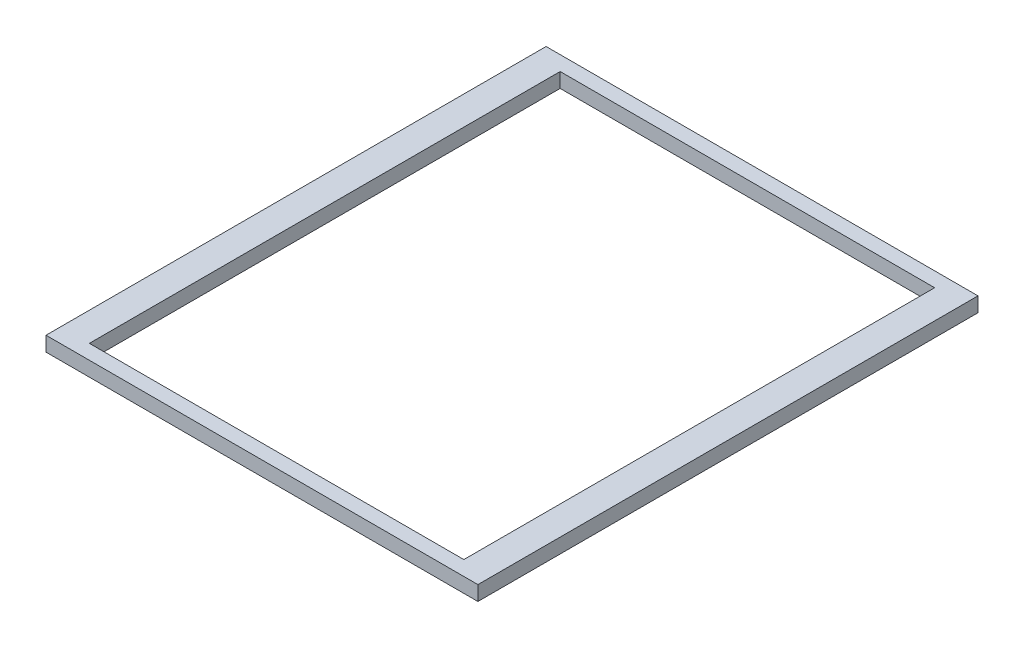
ISO-10303-21;
HEADER;
FILE_DESCRIPTION(('STEP AP214'),'2;1');
FILE_NAME('part.step','',(''),(''),'','','');
FILE_SCHEMA(('AUTOMOTIVE_DESIGN { 1 0 10303 214 1 1 1 1 }'));
ENDSEC;
DATA;
#1=APPLICATION_CONTEXT('core data for automotive mechanical design processes');
#2=APPLICATION_PROTOCOL_DEFINITION('international standard','automotive_design',2000,#1);
#3=PRODUCT_CONTEXT('',#1,'mechanical');
#4=PRODUCT('Part','Part','',(#3));
#5=PRODUCT_RELATED_PRODUCT_CATEGORY('part','',(#4));
#6=PRODUCT_DEFINITION_FORMATION('','',#4);
#7=PRODUCT_DEFINITION_CONTEXT('part definition',#1,'design');
#8=PRODUCT_DEFINITION('design','',#6,#7);
#9=PRODUCT_DEFINITION_SHAPE('','',#8);
#10=(LENGTH_UNIT() NAMED_UNIT(*) SI_UNIT(.MILLI.,.METRE.));
#11=(NAMED_UNIT(*) PLANE_ANGLE_UNIT() SI_UNIT($,.RADIAN.));
#12=(NAMED_UNIT(*) SI_UNIT($,.STERADIAN.) SOLID_ANGLE_UNIT());
#13=UNCERTAINTY_MEASURE_WITH_UNIT(LENGTH_MEASURE(1.E-05),#10,'distance_accuracy_value','');
#14=(GEOMETRIC_REPRESENTATION_CONTEXT(3) GLOBAL_UNCERTAINTY_ASSIGNED_CONTEXT((#13)) GLOBAL_UNIT_ASSIGNED_CONTEXT((#10,
#11,#12)) REPRESENTATION_CONTEXT('',''));
#15=CARTESIAN_POINT('',(0.,0.,0.));
#16=DIRECTION('',(0.,0.,1.));
#17=DIRECTION('',(1.,0.,0.));
#18=AXIS2_PLACEMENT_3D('',#15,#16,#17);
#19=CARTESIAN_POINT('',(-10.27,20.47,328.78));
#20=DIRECTION('',(0.,1.,0.));
#21=DIRECTION('',(0.,0.,1.));
#22=AXIS2_PLACEMENT_3D('',#19,#20,#21);
#23=PLANE('',#22);
#24=DIRECTION('',(-1.,0.,0.));
#25=VECTOR('',#24,1.);
#26=CARTESIAN_POINT('',(261.525,20.47,-328.78));
#27=LINE('',#26,#25);
#28=CARTESIAN_POINT('',(261.525,20.47,-328.78));
#29=VERTEX_POINT('',#28);
#30=CARTESIAN_POINT('',(-261.525,20.47,-328.78));
#31=VERTEX_POINT('',#30);
#32=EDGE_CURVE('E102',#29,#31,#27,.T.);
#33=ORIENTED_EDGE('',*,*,#32,.F.);
#34=DIRECTION('',(0.,0.,-1.));
#35=VECTOR('',#34,1.);
#36=CARTESIAN_POINT('',(261.525,20.47,-328.78));
#37=LINE('',#36,#35);
#38=CARTESIAN_POINT('',(261.525,20.47,328.78));
#39=VERTEX_POINT('',#38);
#40=EDGE_CURVE('E104',#39,#29,#37,.T.);
#41=ORIENTED_EDGE('',*,*,#40,.F.);
#42=DIRECTION('',(1.,0.,0.));
#43=VECTOR('',#42,1.);
#44=CARTESIAN_POINT('',(261.525,20.47,328.78));
#45=LINE('',#44,#43);
#46=CARTESIAN_POINT('',(-261.525,20.47,328.78));
#47=VERTEX_POINT('',#46);
#48=EDGE_CURVE('E11',#47,#39,#45,.T.);
#49=ORIENTED_EDGE('',*,*,#48,.F.);
#50=DIRECTION('',(0.,0.,1.));
#51=VECTOR('',#50,1.);
#52=CARTESIAN_POINT('',(-261.525,20.47,-328.78));
#53=LINE('',#52,#51);
#54=EDGE_CURVE('E106',#31,#47,#53,.T.);
#55=ORIENTED_EDGE('',*,*,#54,.F.);
#56=EDGE_LOOP('',(#33,#41,#49,#55));
#57=FACE_BOUND('',#56,.T.);
#58=DIRECTION('',(-1.,0.,0.));
#59=VECTOR('',#58,1.);
#60=CARTESIAN_POINT('',(-301.625,20.47,-349.25));
#61=LINE('',#60,#59);
#62=CARTESIAN_POINT('',(301.625,20.47,-349.25));
#63=VERTEX_POINT('',#62);
#64=CARTESIAN_POINT('',(-301.625,20.47,-349.25));
#65=VERTEX_POINT('',#64);
#66=EDGE_CURVE('E141',#63,#65,#61,.T.);
#67=ORIENTED_EDGE('',*,*,#66,.T.);
#68=DIRECTION('',(0.,0.,1.));
#69=VECTOR('',#68,1.);
#70=CARTESIAN_POINT('',(-301.625,20.47,349.25));
#71=LINE('',#70,#69);
#72=CARTESIAN_POINT('',(-301.625,20.47,349.25));
#73=VERTEX_POINT('',#72);
#74=EDGE_CURVE('E144',#65,#73,#71,.T.);
#75=ORIENTED_EDGE('',*,*,#74,.T.);
#76=DIRECTION('',(1.,0.,0.));
#77=VECTOR('',#76,1.);
#78=CARTESIAN_POINT('',(-301.625,20.47,349.25));
#79=LINE('',#78,#77);
#80=CARTESIAN_POINT('',(301.625,20.47,349.25));
#81=VERTEX_POINT('',#80);
#82=EDGE_CURVE('E147',#73,#81,#79,.T.);
#83=ORIENTED_EDGE('',*,*,#82,.T.);
#84=DIRECTION('',(0.,0.,-1.));
#85=VECTOR('',#84,1.);
#86=CARTESIAN_POINT('',(301.625,20.47,349.25));
#87=LINE('',#86,#85);
#88=EDGE_CURVE('E137',#81,#63,#87,.T.);
#89=ORIENTED_EDGE('',*,*,#88,.T.);
#90=EDGE_LOOP('',(#67,#75,#83,#89));
#91=FACE_BOUND('',#90,.T.);
#92=ADVANCED_FACE('F34',(#57,#91),#23,.T.);
#93=CARTESIAN_POINT('',(-301.625,20.47,-349.25));
#94=DIRECTION('',(0.,0.,1.));
#95=DIRECTION('',(1.,0.,0.));
#96=AXIS2_PLACEMENT_3D('',#93,#94,#95);
#97=PLANE('',#96);
#98=ORIENTED_EDGE('',*,*,#66,.F.);
#99=DIRECTION('',(0.,-1.,0.));
#100=VECTOR('',#99,1.);
#101=CARTESIAN_POINT('',(301.625,20.47,-349.25));
#102=LINE('',#101,#100);
#103=CARTESIAN_POINT('',(301.625,0.,-349.25));
#104=VERTEX_POINT('',#103);
#105=EDGE_CURVE('E163',#63,#104,#102,.T.);
#106=ORIENTED_EDGE('',*,*,#105,.T.);
#107=DIRECTION('',(-1.,0.,0.));
#108=VECTOR('',#107,1.);
#109=CARTESIAN_POINT('',(-301.625,0.,-349.25));
#110=LINE('',#109,#108);
#111=CARTESIAN_POINT('',(-301.625,0.,-349.25));
#112=VERTEX_POINT('',#111);
#113=EDGE_CURVE('E134',#104,#112,#110,.T.);
#114=ORIENTED_EDGE('',*,*,#113,.T.);
#115=DIRECTION('',(0.,-1.,0.));
#116=VECTOR('',#115,1.);
#117=CARTESIAN_POINT('',(-301.625,20.47,-349.25));
#118=LINE('',#117,#116);
#119=EDGE_CURVE('E160',#65,#112,#118,.T.);
#120=ORIENTED_EDGE('',*,*,#119,.F.);
#121=EDGE_LOOP('',(#98,#106,#114,#120));
#122=FACE_BOUND('',#121,.T.);
#123=ADVANCED_FACE('F167',(#122),#97,.F.);
#124=CARTESIAN_POINT('',(301.625,20.47,349.25));
#125=DIRECTION('',(-1.,0.,0.));
#126=DIRECTION('',(0.,0.,1.));
#127=AXIS2_PLACEMENT_3D('',#124,#125,#126);
#128=PLANE('',#127);
#129=ORIENTED_EDGE('',*,*,#88,.F.);
#130=DIRECTION('',(0.,-1.,0.));
#131=VECTOR('',#130,1.);
#132=CARTESIAN_POINT('',(301.625,20.47,349.25));
#133=LINE('',#132,#131);
#134=CARTESIAN_POINT('',(301.625,0.,349.25));
#135=VERTEX_POINT('',#134);
#136=EDGE_CURVE('E149',#81,#135,#133,.T.);
#137=ORIENTED_EDGE('',*,*,#136,.T.);
#138=DIRECTION('',(0.,0.,-1.));
#139=VECTOR('',#138,1.);
#140=CARTESIAN_POINT('',(301.625,0.,349.25));
#141=LINE('',#140,#139);
#142=EDGE_CURVE('E132',#135,#104,#141,.T.);
#143=ORIENTED_EDGE('',*,*,#142,.T.);
#144=ORIENTED_EDGE('',*,*,#105,.F.);
#145=EDGE_LOOP('',(#129,#137,#143,#144));
#146=FACE_BOUND('',#145,.T.);
#147=ADVANCED_FACE('F171',(#146),#128,.F.);
#148=CARTESIAN_POINT('',(-261.525,20.47,-328.78));
#149=DIRECTION('',(1.,0.,0.));
#150=DIRECTION('',(0.,0.,-1.));
#151=AXIS2_PLACEMENT_3D('',#148,#149,#150);
#152=PLANE('',#151);
#153=DIRECTION('',(0.,-1.,0.));
#154=VECTOR('',#153,1.);
#155=CARTESIAN_POINT('',(-261.525,20.47,-328.78));
#156=LINE('',#155,#154);
#157=CARTESIAN_POINT('',(-261.525,0.,-328.78));
#158=VERTEX_POINT('',#157);
#159=EDGE_CURVE('E110',#31,#158,#156,.T.);
#160=ORIENTED_EDGE('',*,*,#159,.F.);
#161=ORIENTED_EDGE('',*,*,#54,.T.);
#162=DIRECTION('',(0.,-1.,0.));
#163=VECTOR('',#162,1.);
#164=CARTESIAN_POINT('',(-261.525,20.47,328.78));
#165=LINE('',#164,#163);
#166=CARTESIAN_POINT('',(-261.525,0.,328.78));
#167=VERTEX_POINT('',#166);
#168=EDGE_CURVE('E119',#47,#167,#165,.T.);
#169=ORIENTED_EDGE('',*,*,#168,.T.);
#170=DIRECTION('',(0.,0.,1.));
#171=VECTOR('',#170,1.);
#172=CARTESIAN_POINT('',(-261.525,0.,-328.78));
#173=LINE('',#172,#171);
#174=EDGE_CURVE('E43',#158,#167,#173,.T.);
#175=ORIENTED_EDGE('',*,*,#174,.F.);
#176=EDGE_LOOP('',(#160,#161,#169,#175));
#177=FACE_BOUND('',#176,.T.);
#178=ADVANCED_FACE('F130',(#177),#152,.T.);
#179=CARTESIAN_POINT('',(261.525,20.47,-328.78));
#180=DIRECTION('',(-1.,0.,0.));
#181=DIRECTION('',(0.,0.,1.));
#182=AXIS2_PLACEMENT_3D('',#179,#180,#181);
#183=PLANE('',#182);
#184=DIRECTION('',(0.,-1.,0.));
#185=VECTOR('',#184,1.);
#186=CARTESIAN_POINT('',(261.525,20.47,328.78));
#187=LINE('',#186,#185);
#188=CARTESIAN_POINT('',(261.525,0.,328.78));
#189=VERTEX_POINT('',#188);
#190=EDGE_CURVE('E111',#39,#189,#187,.T.);
#191=ORIENTED_EDGE('',*,*,#190,.F.);
#192=ORIENTED_EDGE('',*,*,#40,.T.);
#193=DIRECTION('',(0.,-1.,0.));
#194=VECTOR('',#193,1.);
#195=CARTESIAN_POINT('',(261.525,20.47,-328.78));
#196=LINE('',#195,#194);
#197=CARTESIAN_POINT('',(261.525,0.,-328.78));
#198=VERTEX_POINT('',#197);
#199=EDGE_CURVE('E70',#29,#198,#196,.T.);
#200=ORIENTED_EDGE('',*,*,#199,.T.);
#201=DIRECTION('',(0.,0.,-1.));
#202=VECTOR('',#201,1.);
#203=CARTESIAN_POINT('',(261.525,0.,-328.78));
#204=LINE('',#203,#202);
#205=EDGE_CURVE('E124',#189,#198,#204,.T.);
#206=ORIENTED_EDGE('',*,*,#205,.F.);
#207=EDGE_LOOP('',(#191,#192,#200,#206));
#208=FACE_BOUND('',#207,.T.);
#209=ADVANCED_FACE('F36',(#208),#183,.T.);
#210=CARTESIAN_POINT('',(0.,0.,0.));
#211=DIRECTION('',(0.,-1.,0.));
#212=DIRECTION('',(0.,0.,-1.));
#213=AXIS2_PLACEMENT_3D('',#210,#211,#212);
#214=PLANE('',#213);
#215=ORIENTED_EDGE('',*,*,#142,.F.);
#216=DIRECTION('',(1.,0.,0.));
#217=VECTOR('',#216,1.);
#218=CARTESIAN_POINT('',(-301.625,0.,349.25));
#219=LINE('',#218,#217);
#220=CARTESIAN_POINT('',(-301.625,0.,349.25));
#221=VERTEX_POINT('',#220);
#222=EDGE_CURVE('E140',#221,#135,#219,.T.);
#223=ORIENTED_EDGE('',*,*,#222,.F.);
#224=DIRECTION('',(0.,0.,1.));
#225=VECTOR('',#224,1.);
#226=CARTESIAN_POINT('',(-301.625,0.,349.25));
#227=LINE('',#226,#225);
#228=EDGE_CURVE('E152',#112,#221,#227,.T.);
#229=ORIENTED_EDGE('',*,*,#228,.F.);
#230=ORIENTED_EDGE('',*,*,#113,.F.);
#231=EDGE_LOOP('',(#215,#223,#229,#230));
#232=FACE_BOUND('',#231,.T.);
#233=DIRECTION('',(-1.,0.,0.));
#234=VECTOR('',#233,1.);
#235=CARTESIAN_POINT('',(261.525,0.,-328.78));
#236=LINE('',#235,#234);
#237=EDGE_CURVE('E115',#198,#158,#236,.T.);
#238=ORIENTED_EDGE('',*,*,#237,.T.);
#239=ORIENTED_EDGE('',*,*,#174,.T.);
#240=DIRECTION('',(1.,0.,0.));
#241=VECTOR('',#240,1.);
#242=CARTESIAN_POINT('',(261.525,0.,328.78));
#243=LINE('',#242,#241);
#244=EDGE_CURVE('E51',#167,#189,#243,.T.);
#245=ORIENTED_EDGE('',*,*,#244,.T.);
#246=ORIENTED_EDGE('',*,*,#205,.T.);
#247=EDGE_LOOP('',(#238,#239,#245,#246));
#248=FACE_BOUND('',#247,.T.);
#249=ADVANCED_FACE('F175',(#232,#248),#214,.T.);
#250=CARTESIAN_POINT('',(261.525,20.47,-328.78));
#251=DIRECTION('',(0.,0.,1.));
#252=DIRECTION('',(1.,0.,0.));
#253=AXIS2_PLACEMENT_3D('',#250,#251,#252);
#254=PLANE('',#253);
#255=ORIENTED_EDGE('',*,*,#237,.F.);
#256=ORIENTED_EDGE('',*,*,#199,.F.);
#257=ORIENTED_EDGE('',*,*,#32,.T.);
#258=ORIENTED_EDGE('',*,*,#159,.T.);
#259=EDGE_LOOP('',(#255,#256,#257,#258));
#260=FACE_BOUND('',#259,.T.);
#261=ADVANCED_FACE('F113',(#260),#254,.T.);
#262=CARTESIAN_POINT('',(261.525,20.47,328.78));
#263=DIRECTION('',(0.,0.,-1.));
#264=DIRECTION('',(-1.,0.,0.));
#265=AXIS2_PLACEMENT_3D('',#262,#263,#264);
#266=PLANE('',#265);
#267=ORIENTED_EDGE('',*,*,#244,.F.);
#268=ORIENTED_EDGE('',*,*,#168,.F.);
#269=ORIENTED_EDGE('',*,*,#48,.T.);
#270=ORIENTED_EDGE('',*,*,#190,.T.);
#271=EDGE_LOOP('',(#267,#268,#269,#270));
#272=FACE_BOUND('',#271,.T.);
#273=ADVANCED_FACE('F131',(#272),#266,.T.);
#274=CARTESIAN_POINT('',(-301.625,20.47,349.25));
#275=DIRECTION('',(1.,0.,0.));
#276=DIRECTION('',(0.,0.,-1.));
#277=AXIS2_PLACEMENT_3D('',#274,#275,#276);
#278=PLANE('',#277);
#279=ORIENTED_EDGE('',*,*,#74,.F.);
#280=ORIENTED_EDGE('',*,*,#119,.T.);
#281=ORIENTED_EDGE('',*,*,#228,.T.);
#282=DIRECTION('',(0.,-1.,0.));
#283=VECTOR('',#282,1.);
#284=CARTESIAN_POINT('',(-301.625,20.47,349.25));
#285=LINE('',#284,#283);
#286=EDGE_CURVE('E157',#73,#221,#285,.T.);
#287=ORIENTED_EDGE('',*,*,#286,.F.);
#288=EDGE_LOOP('',(#279,#280,#281,#287));
#289=FACE_BOUND('',#288,.T.);
#290=ADVANCED_FACE('F180',(#289),#278,.F.);
#291=CARTESIAN_POINT('',(-301.625,20.47,349.25));
#292=DIRECTION('',(0.,0.,-1.));
#293=DIRECTION('',(-1.,0.,0.));
#294=AXIS2_PLACEMENT_3D('',#291,#292,#293);
#295=PLANE('',#294);
#296=ORIENTED_EDGE('',*,*,#82,.F.);
#297=ORIENTED_EDGE('',*,*,#286,.T.);
#298=ORIENTED_EDGE('',*,*,#222,.T.);
#299=ORIENTED_EDGE('',*,*,#136,.F.);
#300=EDGE_LOOP('',(#296,#297,#298,#299));
#301=FACE_BOUND('',#300,.T.);
#302=ADVANCED_FACE('F182',(#301),#295,.F.);
#303=CLOSED_SHELL('',(#92,#123,#147,#178,#209,#249,#261,#273,#290,#302));
#304=MANIFOLD_SOLID_BREP('B2',#303);
#305=ADVANCED_BREP_SHAPE_REPRESENTATION('',(#18,#304),#14);
#306=SHAPE_DEFINITION_REPRESENTATION(#9,#305);
ENDSEC;
END-ISO-10303-21;
